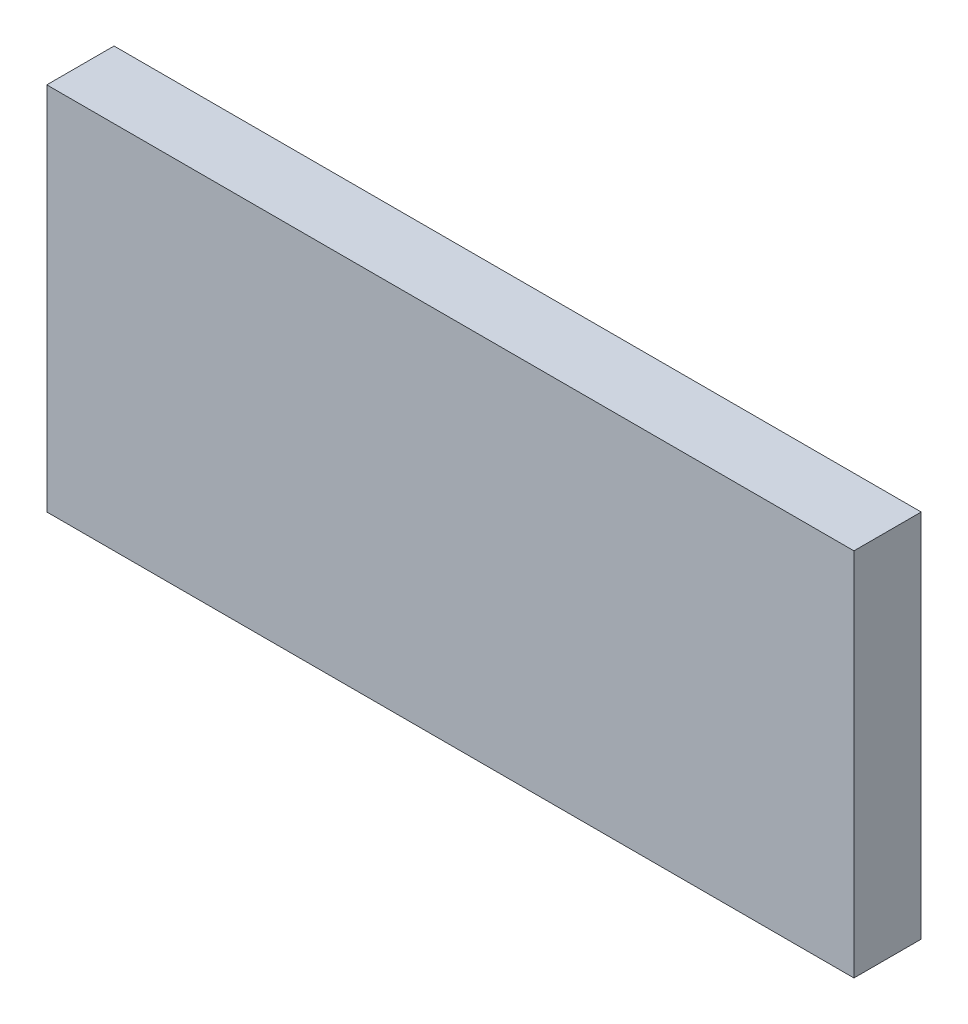
ISO-10303-21;
HEADER;
FILE_DESCRIPTION(('STEP AP214'),'2;1');
FILE_NAME('part.step','',(''),(''),'','','');
FILE_SCHEMA(('AUTOMOTIVE_DESIGN { 1 0 10303 214 1 1 1 1 }'));
ENDSEC;
DATA;
#1=APPLICATION_CONTEXT('core data for automotive mechanical design processes');
#2=APPLICATION_PROTOCOL_DEFINITION('international standard','automotive_design',2000,#1);
#3=PRODUCT_CONTEXT('',#1,'mechanical');
#4=PRODUCT('Part','Part','',(#3));
#5=PRODUCT_RELATED_PRODUCT_CATEGORY('part','',(#4));
#6=PRODUCT_DEFINITION_FORMATION('','',#4);
#7=PRODUCT_DEFINITION_CONTEXT('part definition',#1,'design');
#8=PRODUCT_DEFINITION('design','',#6,#7);
#9=PRODUCT_DEFINITION_SHAPE('','',#8);
#10=(LENGTH_UNIT() NAMED_UNIT(*) SI_UNIT(.MILLI.,.METRE.));
#11=(NAMED_UNIT(*) PLANE_ANGLE_UNIT() SI_UNIT($,.RADIAN.));
#12=(NAMED_UNIT(*) SI_UNIT($,.STERADIAN.) SOLID_ANGLE_UNIT());
#13=UNCERTAINTY_MEASURE_WITH_UNIT(LENGTH_MEASURE(1.E-05),#10,'distance_accuracy_value','');
#14=(GEOMETRIC_REPRESENTATION_CONTEXT(3) GLOBAL_UNCERTAINTY_ASSIGNED_CONTEXT((#13)) GLOBAL_UNIT_ASSIGNED_CONTEXT((#10,
#11,#12)) REPRESENTATION_CONTEXT('',''));
#15=CARTESIAN_POINT('',(0.,0.,0.));
#16=DIRECTION('',(0.,0.,1.));
#17=DIRECTION('',(1.,0.,0.));
#18=AXIS2_PLACEMENT_3D('',#15,#16,#17);
#19=CARTESIAN_POINT('',(-60.,27.5,10.));
#20=DIRECTION('',(1.,0.,0.));
#21=DIRECTION('',(0.,0.,-1.));
#22=AXIS2_PLACEMENT_3D('',#19,#20,#21);
#23=PLANE('',#22);
#24=DIRECTION('',(0.,-1.,0.));
#25=VECTOR('',#24,1.);
#26=CARTESIAN_POINT('',(-60.,27.5,0.));
#27=LINE('',#26,#25);
#28=CARTESIAN_POINT('',(-60.,27.5,0.));
#29=VERTEX_POINT('',#28);
#30=CARTESIAN_POINT('',(-60.,-27.5,0.));
#31=VERTEX_POINT('',#30);
#32=EDGE_CURVE('E107',#29,#31,#27,.T.);
#33=ORIENTED_EDGE('',*,*,#32,.T.);
#34=DIRECTION('',(0.,0.,-1.));
#35=VECTOR('',#34,1.);
#36=CARTESIAN_POINT('',(-60.,-27.5,10.));
#37=LINE('',#36,#35);
#38=CARTESIAN_POINT('',(-60.,-27.5,10.));
#39=VERTEX_POINT('',#38);
#40=EDGE_CURVE('E11',#39,#31,#37,.T.);
#41=ORIENTED_EDGE('',*,*,#40,.F.);
#42=DIRECTION('',(0.,-1.,0.));
#43=VECTOR('',#42,1.);
#44=CARTESIAN_POINT('',(-60.,27.5,10.));
#45=LINE('',#44,#43);
#46=CARTESIAN_POINT('',(-60.,27.5,10.));
#47=VERTEX_POINT('',#46);
#48=EDGE_CURVE('E91',#47,#39,#45,.T.);
#49=ORIENTED_EDGE('',*,*,#48,.F.);
#50=DIRECTION('',(0.,0.,-1.));
#51=VECTOR('',#50,1.);
#52=CARTESIAN_POINT('',(-60.,27.5,10.));
#53=LINE('',#52,#51);
#54=EDGE_CURVE('E103',#47,#29,#53,.T.);
#55=ORIENTED_EDGE('',*,*,#54,.T.);
#56=EDGE_LOOP('',(#33,#41,#49,#55));
#57=FACE_BOUND('',#56,.T.);
#58=ADVANCED_FACE('F39',(#57),#23,.F.);
#59=CARTESIAN_POINT('',(-60.,-27.5,10.));
#60=DIRECTION('',(0.,1.,0.));
#61=DIRECTION('',(0.,0.,1.));
#62=AXIS2_PLACEMENT_3D('',#59,#60,#61);
#63=PLANE('',#62);
#64=DIRECTION('',(1.,0.,0.));
#65=VECTOR('',#64,1.);
#66=CARTESIAN_POINT('',(-60.,-27.5,0.));
#67=LINE('',#66,#65);
#68=CARTESIAN_POINT('',(60.,-27.5,0.));
#69=VERTEX_POINT('',#68);
#70=EDGE_CURVE('E96',#31,#69,#67,.T.);
#71=ORIENTED_EDGE('',*,*,#70,.T.);
#72=DIRECTION('',(0.,0.,-1.));
#73=VECTOR('',#72,1.);
#74=CARTESIAN_POINT('',(60.,-27.5,10.));
#75=LINE('',#74,#73);
#76=CARTESIAN_POINT('',(60.,-27.5,10.));
#77=VERTEX_POINT('',#76);
#78=EDGE_CURVE('E48',#77,#69,#75,.T.);
#79=ORIENTED_EDGE('',*,*,#78,.F.);
#80=DIRECTION('',(1.,0.,0.));
#81=VECTOR('',#80,1.);
#82=CARTESIAN_POINT('',(-60.,-27.5,10.));
#83=LINE('',#82,#81);
#84=EDGE_CURVE('E86',#39,#77,#83,.T.);
#85=ORIENTED_EDGE('',*,*,#84,.F.);
#86=ORIENTED_EDGE('',*,*,#40,.T.);
#87=EDGE_LOOP('',(#71,#79,#85,#86));
#88=FACE_BOUND('',#87,.T.);
#89=ADVANCED_FACE('F95',(#88),#63,.F.);
#90=CARTESIAN_POINT('',(60.,27.5,10.));
#91=DIRECTION('',(-1.,0.,0.));
#92=DIRECTION('',(0.,0.,1.));
#93=AXIS2_PLACEMENT_3D('',#90,#91,#92);
#94=PLANE('',#93);
#95=DIRECTION('',(0.,1.,0.));
#96=VECTOR('',#95,1.);
#97=CARTESIAN_POINT('',(60.,27.5,0.));
#98=LINE('',#97,#96);
#99=CARTESIAN_POINT('',(60.,27.5,0.));
#100=VERTEX_POINT('',#99);
#101=EDGE_CURVE('E73',#69,#100,#98,.T.);
#102=ORIENTED_EDGE('',*,*,#101,.T.);
#103=DIRECTION('',(0.,0.,-1.));
#104=VECTOR('',#103,1.);
#105=CARTESIAN_POINT('',(60.,27.5,10.));
#106=LINE('',#105,#104);
#107=CARTESIAN_POINT('',(60.,27.5,10.));
#108=VERTEX_POINT('',#107);
#109=EDGE_CURVE('E98',#108,#100,#106,.T.);
#110=ORIENTED_EDGE('',*,*,#109,.F.);
#111=DIRECTION('',(0.,1.,0.));
#112=VECTOR('',#111,1.);
#113=CARTESIAN_POINT('',(60.,27.5,10.));
#114=LINE('',#113,#112);
#115=EDGE_CURVE('E89',#77,#108,#114,.T.);
#116=ORIENTED_EDGE('',*,*,#115,.F.);
#117=ORIENTED_EDGE('',*,*,#78,.T.);
#118=EDGE_LOOP('',(#102,#110,#116,#117));
#119=FACE_BOUND('',#118,.T.);
#120=ADVANCED_FACE('F99',(#119),#94,.F.);
#121=CARTESIAN_POINT('',(-60.,27.5,10.));
#122=DIRECTION('',(0.,-1.,0.));
#123=DIRECTION('',(0.,0.,-1.));
#124=AXIS2_PLACEMENT_3D('',#121,#122,#123);
#125=PLANE('',#124);
#126=DIRECTION('',(-1.,0.,0.));
#127=VECTOR('',#126,1.);
#128=CARTESIAN_POINT('',(-60.,27.5,0.));
#129=LINE('',#128,#127);
#130=EDGE_CURVE('E79',#100,#29,#129,.T.);
#131=ORIENTED_EDGE('',*,*,#130,.T.);
#132=ORIENTED_EDGE('',*,*,#54,.F.);
#133=DIRECTION('',(-1.,0.,0.));
#134=VECTOR('',#133,1.);
#135=CARTESIAN_POINT('',(-60.,27.5,10.));
#136=LINE('',#135,#134);
#137=EDGE_CURVE('E56',#108,#47,#136,.T.);
#138=ORIENTED_EDGE('',*,*,#137,.F.);
#139=ORIENTED_EDGE('',*,*,#109,.T.);
#140=EDGE_LOOP('',(#131,#132,#138,#139));
#141=FACE_BOUND('',#140,.T.);
#142=ADVANCED_FACE('F120',(#141),#125,.F.);
#143=CARTESIAN_POINT('',(0.,0.,10.));
#144=DIRECTION('',(0.,0.,1.));
#145=DIRECTION('',(1.,0.,0.));
#146=AXIS2_PLACEMENT_3D('',#143,#144,#145);
#147=PLANE('',#146);
#148=ORIENTED_EDGE('',*,*,#48,.T.);
#149=ORIENTED_EDGE('',*,*,#84,.T.);
#150=ORIENTED_EDGE('',*,*,#115,.T.);
#151=ORIENTED_EDGE('',*,*,#137,.T.);
#152=EDGE_LOOP('',(#148,#149,#150,#151));
#153=FACE_BOUND('',#152,.T.);
#154=ADVANCED_FACE('F87',(#153),#147,.T.);
#155=CARTESIAN_POINT('',(0.,0.,0.));
#156=DIRECTION('',(0.,0.,1.));
#157=DIRECTION('',(1.,0.,0.));
#158=AXIS2_PLACEMENT_3D('',#155,#156,#157);
#159=PLANE('',#158);
#160=ORIENTED_EDGE('',*,*,#32,.F.);
#161=ORIENTED_EDGE('',*,*,#130,.F.);
#162=ORIENTED_EDGE('',*,*,#101,.F.);
#163=ORIENTED_EDGE('',*,*,#70,.F.);
#164=EDGE_LOOP('',(#160,#161,#162,#163));
#165=FACE_BOUND('',#164,.T.);
#166=ADVANCED_FACE('F123',(#165),#159,.F.);
#167=CLOSED_SHELL('',(#58,#89,#120,#142,#154,#166));
#168=MANIFOLD_SOLID_BREP('B2',#167);
#169=ADVANCED_BREP_SHAPE_REPRESENTATION('',(#18,#168),#14);
#170=SHAPE_DEFINITION_REPRESENTATION(#9,#169);
ENDSEC;
END-ISO-10303-21;
